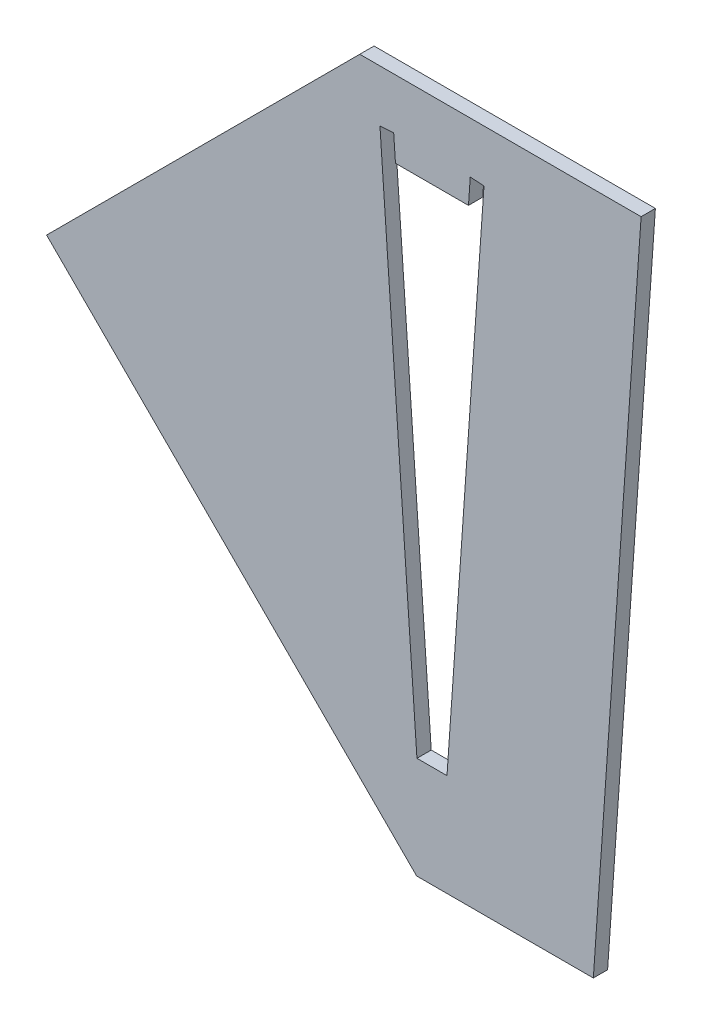
ISO-10303-21;
HEADER;
FILE_DESCRIPTION(('STEP AP214'),'2;1');
FILE_NAME('part.step','',(''),(''),'','','');
FILE_SCHEMA(('AUTOMOTIVE_DESIGN { 1 0 10303 214 1 1 1 1 }'));
ENDSEC;
DATA;
#1=APPLICATION_CONTEXT('core data for automotive mechanical design processes');
#2=APPLICATION_PROTOCOL_DEFINITION('international standard','automotive_design',2000,#1);
#3=PRODUCT_CONTEXT('',#1,'mechanical');
#4=PRODUCT('Part','Part','',(#3));
#5=PRODUCT_RELATED_PRODUCT_CATEGORY('part','',(#4));
#6=PRODUCT_DEFINITION_FORMATION('','',#4);
#7=PRODUCT_DEFINITION_CONTEXT('part definition',#1,'design');
#8=PRODUCT_DEFINITION('design','',#6,#7);
#9=PRODUCT_DEFINITION_SHAPE('','',#8);
#10=(LENGTH_UNIT() NAMED_UNIT(*) SI_UNIT(.MILLI.,.METRE.));
#11=(NAMED_UNIT(*) PLANE_ANGLE_UNIT() SI_UNIT($,.RADIAN.));
#12=(NAMED_UNIT(*) SI_UNIT($,.STERADIAN.) SOLID_ANGLE_UNIT());
#13=UNCERTAINTY_MEASURE_WITH_UNIT(LENGTH_MEASURE(1.E-05),#10,'distance_accuracy_value','');
#14=(GEOMETRIC_REPRESENTATION_CONTEXT(3) GLOBAL_UNCERTAINTY_ASSIGNED_CONTEXT((#13)) GLOBAL_UNIT_ASSIGNED_CONTEXT((#10,
#11,#12)) REPRESENTATION_CONTEXT('',''));
#15=CARTESIAN_POINT('',(0.,0.,0.));
#16=DIRECTION('',(0.,0.,1.));
#17=DIRECTION('',(1.,0.,0.));
#18=AXIS2_PLACEMENT_3D('',#15,#16,#17);
#19=CARTESIAN_POINT('',(0.,0.,2.8));
#20=DIRECTION('',(0.,0.,1.));
#21=DIRECTION('',(1.,0.,0.));
#22=AXIS2_PLACEMENT_3D('',#19,#20,#21);
#23=PLANE('',#22);
#24=DIRECTION('',(0.0697564737441257,0.997564050259824,0.));
#25=VECTOR('',#24,1.);
#26=CARTESIAN_POINT('',(40.9791181866895,112.870740646844,2.8));
#27=LINE('',#26,#25);
#28=CARTESIAN_POINT('',(31.6179640807391,-21.,2.8));
#29=VERTEX_POINT('',#28);
#30=CARTESIAN_POINT('',(40.9791181866895,112.870740646844,2.8));
#31=VERTEX_POINT('',#30);
#32=EDGE_CURVE('E195',#29,#31,#27,.T.);
#33=ORIENTED_EDGE('',*,*,#32,.T.);
#34=DIRECTION('',(-1.,0.,0.));
#35=VECTOR('',#34,1.);
#36=CARTESIAN_POINT('',(40.9791181866895,112.870740646844,2.8));
#37=LINE('',#36,#35);
#38=CARTESIAN_POINT('',(-14.1472160803233,112.870740646844,2.8));
#39=VERTEX_POINT('',#38);
#40=EDGE_CURVE('E198',#31,#39,#37,.T.);
#41=ORIENTED_EDGE('',*,*,#40,.T.);
#42=DIRECTION('',(-0.707106781186549,-0.707106781186546,0.));
#43=VECTOR('',#42,1.);
#44=CARTESIAN_POINT('',(-75.5089783635837,51.508978363584,2.8));
#45=LINE('',#44,#43);
#46=CARTESIAN_POINT('',(-75.5089783635837,51.508978363584,2.8));
#47=VERTEX_POINT('',#46);
#48=EDGE_CURVE('E201',#39,#47,#45,.T.);
#49=ORIENTED_EDGE('',*,*,#48,.T.);
#50=DIRECTION('',(0.707106781186546,-0.707106781186549,0.));
#51=VECTOR('',#50,1.);
#52=CARTESIAN_POINT('',(-75.5089783635837,51.508978363584,2.8));
#53=LINE('',#52,#51);
#54=CARTESIAN_POINT('',(-3.00000000000005,-21.,2.8));
#55=VERTEX_POINT('',#54);
#56=EDGE_CURVE('E203',#47,#55,#53,.T.);
#57=ORIENTED_EDGE('',*,*,#56,.T.);
#58=DIRECTION('',(1.,0.,0.));
#59=VECTOR('',#58,1.);
#60=CARTESIAN_POINT('',(-3.00000000000005,-21.,2.8));
#61=LINE('',#60,#59);
#62=EDGE_CURVE('E205',#55,#29,#61,.T.);
#63=ORIENTED_EDGE('',*,*,#62,.T.);
#64=EDGE_LOOP('',(#33,#41,#49,#57,#63));
#65=FACE_BOUND('',#64,.T.);
#66=DIRECTION('',(0.0697564737441253,-0.997564050259824,0.));
#67=VECTOR('',#66,1.);
#68=CARTESIAN_POINT('',(-10.1934229357015,102.682398167735,2.8));
#69=LINE('',#68,#67);
#70=CARTESIAN_POINT('',(-10.1934229357015,102.682398167735,2.8));
#71=VERTEX_POINT('',#70);
#72=CARTESIAN_POINT('',(-2.94324337717415,-1.,2.8));
#73=VERTEX_POINT('',#72);
#74=EDGE_CURVE('E138',#71,#73,#69,.T.);
#75=ORIENTED_EDGE('',*,*,#74,.F.);
#76=DIRECTION('',(-0.997564050259824,-0.0697564737441242,0.));
#77=VECTOR('',#76,1.);
#78=CARTESIAN_POINT('',(-7.5,102.870740646844,2.8));
#79=LINE('',#78,#77);
#80=CARTESIAN_POINT('',(-7.5,102.870740646844,2.8));
#81=VERTEX_POINT('',#80);
#82=EDGE_CURVE('E130',#81,#71,#79,.T.);
#83=ORIENTED_EDGE('',*,*,#82,.F.);
#84=DIRECTION('',(-0.0697564737441254,0.997564050259824,0.));
#85=VECTOR('',#84,1.);
#86=CARTESIAN_POINT('',(-7.15036594028245,97.8707406468441,2.8));
#87=LINE('',#86,#85);
#88=CARTESIAN_POINT('',(-7.15036594028245,97.8707406468441,2.8));
#89=VERTEX_POINT('',#88);
#90=EDGE_CURVE('E163',#89,#81,#87,.T.);
#91=ORIENTED_EDGE('',*,*,#90,.F.);
#92=DIRECTION('',(-1.,0.,0.));
#93=VECTOR('',#92,1.);
#94=CARTESIAN_POINT('',(-7.15036594028245,97.8707406468441,2.8));
#95=LINE('',#94,#93);
#96=CARTESIAN_POINT('',(7.15036594028245,97.8707406468441,2.8));
#97=VERTEX_POINT('',#96);
#98=EDGE_CURVE('E161',#97,#89,#95,.T.);
#99=ORIENTED_EDGE('',*,*,#98,.F.);
#100=DIRECTION('',(-0.0697564737441254,-0.997564050259824,0.));
#101=VECTOR('',#100,1.);
#102=CARTESIAN_POINT('',(7.15036594028245,97.8707406468441,2.8));
#103=LINE('',#102,#101);
#104=CARTESIAN_POINT('',(7.5,102.870740646844,2.8));
#105=VERTEX_POINT('',#104);
#106=EDGE_CURVE('E159',#105,#97,#103,.T.);
#107=ORIENTED_EDGE('',*,*,#106,.F.);
#108=DIRECTION('',(-0.997564050259824,0.0697564737441242,0.));
#109=VECTOR('',#108,1.);
#110=CARTESIAN_POINT('',(7.5,102.870740646844,2.8));
#111=LINE('',#110,#109);
#112=CARTESIAN_POINT('',(10.1934229357015,102.682398167735,2.8));
#113=VERTEX_POINT('',#112);
#114=EDGE_CURVE('E157',#113,#105,#111,.T.);
#115=ORIENTED_EDGE('',*,*,#114,.F.);
#116=DIRECTION('',(0.0697564737441253,0.997564050259824,0.));
#117=VECTOR('',#116,1.);
#118=CARTESIAN_POINT('',(10.1934229357015,102.682398167735,2.8));
#119=LINE('',#118,#117);
#120=CARTESIAN_POINT('',(2.94324337717415,-1.,2.8));
#121=VERTEX_POINT('',#120);
#122=EDGE_CURVE('E153',#121,#113,#119,.T.);
#123=ORIENTED_EDGE('',*,*,#122,.F.);
#124=DIRECTION('',(1.,0.,0.));
#125=VECTOR('',#124,1.);
#126=CARTESIAN_POINT('',(-2.94324337717415,-1.,2.8));
#127=LINE('',#126,#125);
#128=EDGE_CURVE('E151',#73,#121,#127,.T.);
#129=ORIENTED_EDGE('',*,*,#128,.F.);
#130=EDGE_LOOP('',(#75,#83,#91,#99,#107,#115,#123,#129));
#131=FACE_BOUND('',#130,.T.);
#132=ADVANCED_FACE('F35',(#65,#131),#23,.T.);
#133=CARTESIAN_POINT('',(0.,0.,0.));
#134=DIRECTION('',(0.,0.,1.));
#135=DIRECTION('',(1.,0.,0.));
#136=AXIS2_PLACEMENT_3D('',#133,#134,#135);
#137=PLANE('',#136);
#138=DIRECTION('',(0.0697564737441257,0.997564050259824,0.));
#139=VECTOR('',#138,1.);
#140=CARTESIAN_POINT('',(40.9791181866895,112.870740646844,0.));
#141=LINE('',#140,#139);
#142=CARTESIAN_POINT('',(31.6179640807391,-21.,0.));
#143=VERTEX_POINT('',#142);
#144=CARTESIAN_POINT('',(40.9791181866895,112.870740646844,0.));
#145=VERTEX_POINT('',#144);
#146=EDGE_CURVE('E146',#143,#145,#141,.T.);
#147=ORIENTED_EDGE('',*,*,#146,.F.);
#148=DIRECTION('',(1.,0.,0.));
#149=VECTOR('',#148,1.);
#150=CARTESIAN_POINT('',(-3.00000000000005,-21.,0.));
#151=LINE('',#150,#149);
#152=CARTESIAN_POINT('',(-3.00000000000005,-21.,0.));
#153=VERTEX_POINT('',#152);
#154=EDGE_CURVE('E199',#153,#143,#151,.T.);
#155=ORIENTED_EDGE('',*,*,#154,.F.);
#156=DIRECTION('',(0.707106781186546,-0.707106781186549,0.));
#157=VECTOR('',#156,1.);
#158=CARTESIAN_POINT('',(-75.5089783635837,51.508978363584,0.));
#159=LINE('',#158,#157);
#160=CARTESIAN_POINT('',(-75.5089783635837,51.508978363584,0.));
#161=VERTEX_POINT('',#160);
#162=EDGE_CURVE('E214',#161,#153,#159,.T.);
#163=ORIENTED_EDGE('',*,*,#162,.F.);
#164=DIRECTION('',(-0.707106781186549,-0.707106781186546,0.));
#165=VECTOR('',#164,1.);
#166=CARTESIAN_POINT('',(-75.5089783635837,51.508978363584,0.));
#167=LINE('',#166,#165);
#168=CARTESIAN_POINT('',(-14.1472160803233,112.870740646844,0.));
#169=VERTEX_POINT('',#168);
#170=EDGE_CURVE('E212',#169,#161,#167,.T.);
#171=ORIENTED_EDGE('',*,*,#170,.F.);
#172=DIRECTION('',(-1.,0.,0.));
#173=VECTOR('',#172,1.);
#174=CARTESIAN_POINT('',(40.9791181866895,112.870740646844,0.));
#175=LINE('',#174,#173);
#176=EDGE_CURVE('E210',#145,#169,#175,.T.);
#177=ORIENTED_EDGE('',*,*,#176,.F.);
#178=EDGE_LOOP('',(#147,#155,#163,#171,#177));
#179=FACE_BOUND('',#178,.T.);
#180=DIRECTION('',(-0.997564050259824,-0.0697564737441242,0.));
#181=VECTOR('',#180,1.);
#182=CARTESIAN_POINT('',(-7.5,102.870740646844,0.));
#183=LINE('',#182,#181);
#184=CARTESIAN_POINT('',(-7.5,102.870740646844,0.));
#185=VERTEX_POINT('',#184);
#186=CARTESIAN_POINT('',(-10.1934229357015,102.682398167735,0.));
#187=VERTEX_POINT('',#186);
#188=EDGE_CURVE('E58',#185,#187,#183,.T.);
#189=ORIENTED_EDGE('',*,*,#188,.T.);
#190=DIRECTION('',(0.0697564737441253,-0.997564050259824,0.));
#191=VECTOR('',#190,1.);
#192=CARTESIAN_POINT('',(-10.1934229357015,102.682398167735,0.));
#193=LINE('',#192,#191);
#194=CARTESIAN_POINT('',(-2.94324337717415,-1.,0.));
#195=VERTEX_POINT('',#194);
#196=EDGE_CURVE('E145',#187,#195,#193,.T.);
#197=ORIENTED_EDGE('',*,*,#196,.T.);
#198=DIRECTION('',(1.,0.,0.));
#199=VECTOR('',#198,1.);
#200=CARTESIAN_POINT('',(-2.94324337717415,-1.,0.));
#201=LINE('',#200,#199);
#202=CARTESIAN_POINT('',(2.94324337717415,-1.,0.));
#203=VERTEX_POINT('',#202);
#204=EDGE_CURVE('E167',#195,#203,#201,.T.);
#205=ORIENTED_EDGE('',*,*,#204,.T.);
#206=DIRECTION('',(0.0697564737441253,0.997564050259824,0.));
#207=VECTOR('',#206,1.);
#208=CARTESIAN_POINT('',(10.1934229357015,102.682398167735,0.));
#209=LINE('',#208,#207);
#210=CARTESIAN_POINT('',(10.1934229357015,102.682398167735,0.));
#211=VERTEX_POINT('',#210);
#212=EDGE_CURVE('E170',#203,#211,#209,.T.);
#213=ORIENTED_EDGE('',*,*,#212,.T.);
#214=DIRECTION('',(-0.997564050259824,0.0697564737441242,0.));
#215=VECTOR('',#214,1.);
#216=CARTESIAN_POINT('',(7.5,102.870740646844,0.));
#217=LINE('',#216,#215);
#218=CARTESIAN_POINT('',(7.5,102.870740646844,0.));
#219=VERTEX_POINT('',#218);
#220=EDGE_CURVE('E173',#211,#219,#217,.T.);
#221=ORIENTED_EDGE('',*,*,#220,.T.);
#222=DIRECTION('',(-0.0697564737441254,-0.997564050259824,0.));
#223=VECTOR('',#222,1.);
#224=CARTESIAN_POINT('',(7.15036594028245,97.8707406468441,0.));
#225=LINE('',#224,#223);
#226=CARTESIAN_POINT('',(7.15036594028245,97.8707406468441,0.));
#227=VERTEX_POINT('',#226);
#228=EDGE_CURVE('E176',#219,#227,#225,.T.);
#229=ORIENTED_EDGE('',*,*,#228,.T.);
#230=DIRECTION('',(-1.,0.,0.));
#231=VECTOR('',#230,1.);
#232=CARTESIAN_POINT('',(-7.15036594028245,97.8707406468441,0.));
#233=LINE('',#232,#231);
#234=CARTESIAN_POINT('',(-7.15036594028245,97.8707406468441,0.));
#235=VERTEX_POINT('',#234);
#236=EDGE_CURVE('E179',#227,#235,#233,.T.);
#237=ORIENTED_EDGE('',*,*,#236,.T.);
#238=DIRECTION('',(-0.0697564737441254,0.997564050259824,0.));
#239=VECTOR('',#238,1.);
#240=CARTESIAN_POINT('',(-7.15036594028245,97.8707406468441,0.));
#241=LINE('',#240,#239);
#242=EDGE_CURVE('E139',#235,#185,#241,.T.);
#243=ORIENTED_EDGE('',*,*,#242,.T.);
#244=EDGE_LOOP('',(#189,#197,#205,#213,#221,#229,#237,#243));
#245=FACE_BOUND('',#244,.T.);
#246=ADVANCED_FACE('F235',(#179,#245),#137,.F.);
#247=CARTESIAN_POINT('',(40.9791181866895,112.870740646844,2.8));
#248=DIRECTION('',(-0.997564050259824,0.0697564737441257,0.));
#249=DIRECTION('',(-0.0697564737441257,-0.997564050259824,0.));
#250=AXIS2_PLACEMENT_3D('',#247,#248,#249);
#251=PLANE('',#250);
#252=ORIENTED_EDGE('',*,*,#146,.T.);
#253=DIRECTION('',(0.,0.,-1.));
#254=VECTOR('',#253,1.);
#255=CARTESIAN_POINT('',(40.9791181866895,112.870740646844,2.8));
#256=LINE('',#255,#254);
#257=EDGE_CURVE('E11',#31,#145,#256,.T.);
#258=ORIENTED_EDGE('',*,*,#257,.F.);
#259=ORIENTED_EDGE('',*,*,#32,.F.);
#260=DIRECTION('',(0.,0.,-1.));
#261=VECTOR('',#260,1.);
#262=CARTESIAN_POINT('',(31.6179640807391,-21.,2.8));
#263=LINE('',#262,#261);
#264=EDGE_CURVE('E207',#29,#143,#263,.T.);
#265=ORIENTED_EDGE('',*,*,#264,.T.);
#266=EDGE_LOOP('',(#252,#258,#259,#265));
#267=FACE_BOUND('',#266,.T.);
#268=ADVANCED_FACE('F37',(#267),#251,.F.);
#269=CARTESIAN_POINT('',(40.9791181866895,112.870740646844,2.8));
#270=DIRECTION('',(0.,-1.,0.));
#271=DIRECTION('',(0.,0.,-1.));
#272=AXIS2_PLACEMENT_3D('',#269,#270,#271);
#273=PLANE('',#272);
#274=ORIENTED_EDGE('',*,*,#176,.T.);
#275=DIRECTION('',(0.,0.,-1.));
#276=VECTOR('',#275,1.);
#277=CARTESIAN_POINT('',(-14.1472160803233,112.870740646844,2.8));
#278=LINE('',#277,#276);
#279=EDGE_CURVE('E43',#39,#169,#278,.T.);
#280=ORIENTED_EDGE('',*,*,#279,.F.);
#281=ORIENTED_EDGE('',*,*,#40,.F.);
#282=ORIENTED_EDGE('',*,*,#257,.T.);
#283=EDGE_LOOP('',(#274,#280,#281,#282));
#284=FACE_BOUND('',#283,.T.);
#285=ADVANCED_FACE('F249',(#284),#273,.F.);
#286=CARTESIAN_POINT('',(-75.5089783635837,51.508978363584,2.8));
#287=DIRECTION('',(0.707106781186546,-0.707106781186549,0.));
#288=DIRECTION('',(0.707106781186549,0.707106781186546,0.));
#289=AXIS2_PLACEMENT_3D('',#286,#287,#288);
#290=PLANE('',#289);
#291=ORIENTED_EDGE('',*,*,#170,.T.);
#292=DIRECTION('',(0.,0.,-1.));
#293=VECTOR('',#292,1.);
#294=CARTESIAN_POINT('',(-75.5089783635837,51.508978363584,2.8));
#295=LINE('',#294,#293);
#296=EDGE_CURVE('E222',#47,#161,#295,.T.);
#297=ORIENTED_EDGE('',*,*,#296,.F.);
#298=ORIENTED_EDGE('',*,*,#48,.F.);
#299=ORIENTED_EDGE('',*,*,#279,.T.);
#300=EDGE_LOOP('',(#291,#297,#298,#299));
#301=FACE_BOUND('',#300,.T.);
#302=ADVANCED_FACE('F229',(#301),#290,.F.);
#303=CARTESIAN_POINT('',(-75.5089783635837,51.508978363584,2.8));
#304=DIRECTION('',(0.707106781186549,0.707106781186546,0.));
#305=DIRECTION('',(-0.707106781186546,0.707106781186549,0.));
#306=AXIS2_PLACEMENT_3D('',#303,#304,#305);
#307=PLANE('',#306);
#308=ORIENTED_EDGE('',*,*,#162,.T.);
#309=DIRECTION('',(0.,0.,-1.));
#310=VECTOR('',#309,1.);
#311=CARTESIAN_POINT('',(-3.00000000000005,-21.,2.8));
#312=LINE('',#311,#310);
#313=EDGE_CURVE('E219',#55,#153,#312,.T.);
#314=ORIENTED_EDGE('',*,*,#313,.F.);
#315=ORIENTED_EDGE('',*,*,#56,.F.);
#316=ORIENTED_EDGE('',*,*,#296,.T.);
#317=EDGE_LOOP('',(#308,#314,#315,#316));
#318=FACE_BOUND('',#317,.T.);
#319=ADVANCED_FACE('F240',(#318),#307,.F.);
#320=CARTESIAN_POINT('',(-3.00000000000005,-21.,2.8));
#321=DIRECTION('',(0.,1.,0.));
#322=DIRECTION('',(-1.,0.,0.));
#323=AXIS2_PLACEMENT_3D('',#320,#321,#322);
#324=PLANE('',#323);
#325=ORIENTED_EDGE('',*,*,#154,.T.);
#326=ORIENTED_EDGE('',*,*,#264,.F.);
#327=ORIENTED_EDGE('',*,*,#62,.F.);
#328=ORIENTED_EDGE('',*,*,#313,.T.);
#329=EDGE_LOOP('',(#325,#326,#327,#328));
#330=FACE_BOUND('',#329,.T.);
#331=ADVANCED_FACE('F244',(#330),#324,.F.);
#332=CARTESIAN_POINT('',(-7.5,102.870740646844,2.8));
#333=DIRECTION('',(0.0697564737441242,-0.997564050259824,0.));
#334=DIRECTION('',(0.997564050259824,0.0697564737441242,0.));
#335=AXIS2_PLACEMENT_3D('',#332,#333,#334);
#336=PLANE('',#335);
#337=ORIENTED_EDGE('',*,*,#188,.F.);
#338=DIRECTION('',(0.,0.,-1.));
#339=VECTOR('',#338,1.);
#340=CARTESIAN_POINT('',(-7.5,102.870740646844,2.8));
#341=LINE('',#340,#339);
#342=EDGE_CURVE('E134',#81,#185,#341,.T.);
#343=ORIENTED_EDGE('',*,*,#342,.F.);
#344=ORIENTED_EDGE('',*,*,#82,.T.);
#345=DIRECTION('',(0.,0.,-1.));
#346=VECTOR('',#345,1.);
#347=CARTESIAN_POINT('',(-10.1934229357015,102.682398167735,2.8));
#348=LINE('',#347,#346);
#349=EDGE_CURVE('E133',#71,#187,#348,.T.);
#350=ORIENTED_EDGE('',*,*,#349,.T.);
#351=EDGE_LOOP('',(#337,#343,#344,#350));
#352=FACE_BOUND('',#351,.T.);
#353=ADVANCED_FACE('F132',(#352),#336,.T.);
#354=CARTESIAN_POINT('',(-10.1934229357015,102.682398167735,2.8));
#355=DIRECTION('',(0.997564050259824,0.0697564737441253,0.));
#356=DIRECTION('',(-0.0697564737441253,0.997564050259824,0.));
#357=AXIS2_PLACEMENT_3D('',#354,#355,#356);
#358=PLANE('',#357);
#359=ORIENTED_EDGE('',*,*,#196,.F.);
#360=ORIENTED_EDGE('',*,*,#349,.F.);
#361=ORIENTED_EDGE('',*,*,#74,.T.);
#362=DIRECTION('',(0.,0.,-1.));
#363=VECTOR('',#362,1.);
#364=CARTESIAN_POINT('',(-2.94324337717415,-1.,2.8));
#365=LINE('',#364,#363);
#366=EDGE_CURVE('E147',#73,#195,#365,.T.);
#367=ORIENTED_EDGE('',*,*,#366,.T.);
#368=EDGE_LOOP('',(#359,#360,#361,#367));
#369=FACE_BOUND('',#368,.T.);
#370=ADVANCED_FACE('F142',(#369),#358,.T.);
#371=CARTESIAN_POINT('',(-2.94324337717415,-1.,2.8));
#372=DIRECTION('',(0.,1.,0.));
#373=DIRECTION('',(0.,0.,1.));
#374=AXIS2_PLACEMENT_3D('',#371,#372,#373);
#375=PLANE('',#374);
#376=ORIENTED_EDGE('',*,*,#204,.F.);
#377=ORIENTED_EDGE('',*,*,#366,.F.);
#378=ORIENTED_EDGE('',*,*,#128,.T.);
#379=DIRECTION('',(0.,0.,-1.));
#380=VECTOR('',#379,1.);
#381=CARTESIAN_POINT('',(2.94324337717415,-1.,2.8));
#382=LINE('',#381,#380);
#383=EDGE_CURVE('E192',#121,#203,#382,.T.);
#384=ORIENTED_EDGE('',*,*,#383,.T.);
#385=EDGE_LOOP('',(#376,#377,#378,#384));
#386=FACE_BOUND('',#385,.T.);
#387=ADVANCED_FACE('F292',(#386),#375,.T.);
#388=CARTESIAN_POINT('',(10.1934229357015,102.682398167735,2.8));
#389=DIRECTION('',(-0.997564050259824,0.0697564737441253,0.));
#390=DIRECTION('',(-0.0697564737441253,-0.997564050259824,0.));
#391=AXIS2_PLACEMENT_3D('',#388,#389,#390);
#392=PLANE('',#391);
#393=ORIENTED_EDGE('',*,*,#212,.F.);
#394=ORIENTED_EDGE('',*,*,#383,.F.);
#395=ORIENTED_EDGE('',*,*,#122,.T.);
#396=DIRECTION('',(0.,0.,-1.));
#397=VECTOR('',#396,1.);
#398=CARTESIAN_POINT('',(10.1934229357015,102.682398167735,2.8));
#399=LINE('',#398,#397);
#400=EDGE_CURVE('E190',#113,#211,#399,.T.);
#401=ORIENTED_EDGE('',*,*,#400,.T.);
#402=EDGE_LOOP('',(#393,#394,#395,#401));
#403=FACE_BOUND('',#402,.T.);
#404=ADVANCED_FACE('F298',(#403),#392,.T.);
#405=CARTESIAN_POINT('',(7.5,102.870740646844,2.8));
#406=DIRECTION('',(-0.0697564737441242,-0.997564050259824,0.));
#407=DIRECTION('',(0.997564050259824,-0.0697564737441242,0.));
#408=AXIS2_PLACEMENT_3D('',#405,#406,#407);
#409=PLANE('',#408);
#410=ORIENTED_EDGE('',*,*,#220,.F.);
#411=ORIENTED_EDGE('',*,*,#400,.F.);
#412=ORIENTED_EDGE('',*,*,#114,.T.);
#413=DIRECTION('',(0.,0.,-1.));
#414=VECTOR('',#413,1.);
#415=CARTESIAN_POINT('',(7.5,102.870740646844,2.8));
#416=LINE('',#415,#414);
#417=EDGE_CURVE('E188',#105,#219,#416,.T.);
#418=ORIENTED_EDGE('',*,*,#417,.T.);
#419=EDGE_LOOP('',(#410,#411,#412,#418));
#420=FACE_BOUND('',#419,.T.);
#421=ADVANCED_FACE('F306',(#420),#409,.T.);
#422=CARTESIAN_POINT('',(7.15036594028245,97.8707406468441,2.8));
#423=DIRECTION('',(0.997564050259824,-0.0697564737441254,0.));
#424=DIRECTION('',(0.0697564737441254,0.997564050259824,0.));
#425=AXIS2_PLACEMENT_3D('',#422,#423,#424);
#426=PLANE('',#425);
#427=ORIENTED_EDGE('',*,*,#228,.F.);
#428=ORIENTED_EDGE('',*,*,#417,.F.);
#429=ORIENTED_EDGE('',*,*,#106,.T.);
#430=DIRECTION('',(0.,0.,-1.));
#431=VECTOR('',#430,1.);
#432=CARTESIAN_POINT('',(7.15036594028245,97.8707406468441,2.8));
#433=LINE('',#432,#431);
#434=EDGE_CURVE('E186',#97,#227,#433,.T.);
#435=ORIENTED_EDGE('',*,*,#434,.T.);
#436=EDGE_LOOP('',(#427,#428,#429,#435));
#437=FACE_BOUND('',#436,.T.);
#438=ADVANCED_FACE('F314',(#437),#426,.T.);
#439=CARTESIAN_POINT('',(-7.15036594028245,97.8707406468441,2.8));
#440=DIRECTION('',(0.,-1.,0.));
#441=DIRECTION('',(0.,0.,-1.));
#442=AXIS2_PLACEMENT_3D('',#439,#440,#441);
#443=PLANE('',#442);
#444=ORIENTED_EDGE('',*,*,#236,.F.);
#445=ORIENTED_EDGE('',*,*,#434,.F.);
#446=ORIENTED_EDGE('',*,*,#98,.T.);
#447=DIRECTION('',(0.,0.,-1.));
#448=VECTOR('',#447,1.);
#449=CARTESIAN_POINT('',(-7.15036594028245,97.8707406468441,2.8));
#450=LINE('',#449,#448);
#451=EDGE_CURVE('E50',#89,#235,#450,.T.);
#452=ORIENTED_EDGE('',*,*,#451,.T.);
#453=EDGE_LOOP('',(#444,#445,#446,#452));
#454=FACE_BOUND('',#453,.T.);
#455=ADVANCED_FACE('F322',(#454),#443,.T.);
#456=CARTESIAN_POINT('',(-7.15036594028245,97.8707406468441,2.8));
#457=DIRECTION('',(-0.997564050259824,-0.0697564737441254,0.));
#458=DIRECTION('',(0.0697564737441254,-0.997564050259824,0.));
#459=AXIS2_PLACEMENT_3D('',#456,#457,#458);
#460=PLANE('',#459);
#461=ORIENTED_EDGE('',*,*,#242,.F.);
#462=ORIENTED_EDGE('',*,*,#451,.F.);
#463=ORIENTED_EDGE('',*,*,#90,.T.);
#464=ORIENTED_EDGE('',*,*,#342,.T.);
#465=EDGE_LOOP('',(#461,#462,#463,#464));
#466=FACE_BOUND('',#465,.T.);
#467=ADVANCED_FACE('F330',(#466),#460,.T.);
#468=CLOSED_SHELL('',(#132,#246,#268,#285,#302,#319,#331,#353,#370,#387,#404,#421,#438,#455,#467));
#469=MANIFOLD_SOLID_BREP('B2',#468);
#470=ADVANCED_BREP_SHAPE_REPRESENTATION('',(#18,#469),#14);
#471=SHAPE_DEFINITION_REPRESENTATION(#9,#470);
ENDSEC;
END-ISO-10303-21;
